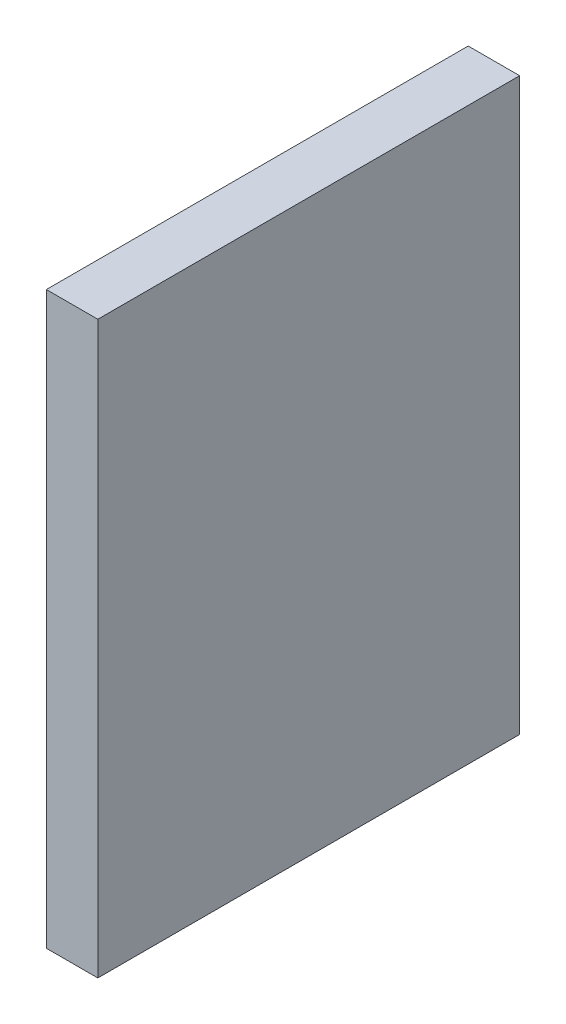
ISO-10303-21;
HEADER;
FILE_DESCRIPTION(('STEP AP214'),'2;1');
FILE_NAME('part.step','',(''),(''),'','','');
FILE_SCHEMA(('AUTOMOTIVE_DESIGN { 1 0 10303 214 1 1 1 1 }'));
ENDSEC;
DATA;
#1=APPLICATION_CONTEXT('core data for automotive mechanical design processes');
#2=APPLICATION_PROTOCOL_DEFINITION('international standard','automotive_design',2000,#1);
#3=PRODUCT_CONTEXT('',#1,'mechanical');
#4=PRODUCT('Part','Part','',(#3));
#5=PRODUCT_RELATED_PRODUCT_CATEGORY('part','',(#4));
#6=PRODUCT_DEFINITION_FORMATION('','',#4);
#7=PRODUCT_DEFINITION_CONTEXT('part definition',#1,'design');
#8=PRODUCT_DEFINITION('design','',#6,#7);
#9=PRODUCT_DEFINITION_SHAPE('','',#8);
#10=(LENGTH_UNIT() NAMED_UNIT(*) SI_UNIT(.MILLI.,.METRE.));
#11=(NAMED_UNIT(*) PLANE_ANGLE_UNIT() SI_UNIT($,.RADIAN.));
#12=(NAMED_UNIT(*) SI_UNIT($,.STERADIAN.) SOLID_ANGLE_UNIT());
#13=UNCERTAINTY_MEASURE_WITH_UNIT(LENGTH_MEASURE(1.E-05),#10,'distance_accuracy_value','');
#14=(GEOMETRIC_REPRESENTATION_CONTEXT(3) GLOBAL_UNCERTAINTY_ASSIGNED_CONTEXT((#13)) GLOBAL_UNIT_ASSIGNED_CONTEXT((#10,
#11,#12)) REPRESENTATION_CONTEXT('',''));
#15=CARTESIAN_POINT('',(0.,0.,0.));
#16=DIRECTION('',(0.,0.,1.));
#17=DIRECTION('',(1.,0.,0.));
#18=AXIS2_PLACEMENT_3D('',#15,#16,#17);
#19=CARTESIAN_POINT('',(3.,-21.4079773002372,25.6905155489982));
#20=DIRECTION('',(0.,1.,0.));
#21=DIRECTION('',(0.,0.,1.));
#22=AXIS2_PLACEMENT_3D('',#19,#20,#21);
#23=PLANE('',#22);
#24=DIRECTION('',(0.,0.,-1.));
#25=VECTOR('',#24,1.);
#26=CARTESIAN_POINT('',(0.,-21.4079773002372,25.6905155489982));
#27=LINE('',#26,#25);
#28=CARTESIAN_POINT('',(0.,-21.4079773002372,25.6905155489982));
#29=VERTEX_POINT('',#28);
#30=CARTESIAN_POINT('',(0.,-21.4079773002372,1.09051554899822));
#31=VERTEX_POINT('',#30);
#32=EDGE_CURVE('E96',#29,#31,#27,.T.);
#33=ORIENTED_EDGE('',*,*,#32,.T.);
#34=DIRECTION('',(-1.,0.,0.));
#35=VECTOR('',#34,1.);
#36=CARTESIAN_POINT('',(3.,-21.4079773002372,1.09051554899822));
#37=LINE('',#36,#35);
#38=CARTESIAN_POINT('',(3.,-21.4079773002372,1.09051554899822));
#39=VERTEX_POINT('',#38);
#40=EDGE_CURVE('E11',#39,#31,#37,.T.);
#41=ORIENTED_EDGE('',*,*,#40,.F.);
#42=DIRECTION('',(0.,0.,-1.));
#43=VECTOR('',#42,1.);
#44=CARTESIAN_POINT('',(3.,-21.4079773002372,25.6905155489982));
#45=LINE('',#44,#43);
#46=CARTESIAN_POINT('',(3.,-21.4079773002372,25.6905155489982));
#47=VERTEX_POINT('',#46);
#48=EDGE_CURVE('E84',#47,#39,#45,.T.);
#49=ORIENTED_EDGE('',*,*,#48,.F.);
#50=DIRECTION('',(-1.,0.,0.));
#51=VECTOR('',#50,1.);
#52=CARTESIAN_POINT('',(3.,-21.4079773002372,25.6905155489982));
#53=LINE('',#52,#51);
#54=EDGE_CURVE('E92',#47,#29,#53,.T.);
#55=ORIENTED_EDGE('',*,*,#54,.T.);
#56=EDGE_LOOP('',(#33,#41,#49,#55));
#57=FACE_BOUND('',#56,.T.);
#58=ADVANCED_FACE('F33',(#57),#23,.F.);
#59=CARTESIAN_POINT('',(3.,-21.4079773002372,1.09051554899822));
#60=DIRECTION('',(0.,0.,1.));
#61=DIRECTION('',(1.,0.,0.));
#62=AXIS2_PLACEMENT_3D('',#59,#60,#61);
#63=PLANE('',#62);
#64=DIRECTION('',(0.,1.,0.));
#65=VECTOR('',#64,1.);
#66=CARTESIAN_POINT('',(0.,-21.4079773002372,1.09051554899822));
#67=LINE('',#66,#65);
#68=CARTESIAN_POINT('',(0.,11.8622632455059,1.09051554899822));
#69=VERTEX_POINT('',#68);
#70=EDGE_CURVE('E88',#31,#69,#67,.T.);
#71=ORIENTED_EDGE('',*,*,#70,.T.);
#72=DIRECTION('',(-1.,0.,0.));
#73=VECTOR('',#72,1.);
#74=CARTESIAN_POINT('',(3.,11.8622632455059,1.09051554899822));
#75=LINE('',#74,#73);
#76=CARTESIAN_POINT('',(3.,11.8622632455059,1.09051554899822));
#77=VERTEX_POINT('',#76);
#78=EDGE_CURVE('E41',#77,#69,#75,.T.);
#79=ORIENTED_EDGE('',*,*,#78,.F.);
#80=DIRECTION('',(0.,1.,0.));
#81=VECTOR('',#80,1.);
#82=CARTESIAN_POINT('',(3.,-21.4079773002372,1.09051554899822));
#83=LINE('',#82,#81);
#84=EDGE_CURVE('E79',#39,#77,#83,.T.);
#85=ORIENTED_EDGE('',*,*,#84,.F.);
#86=ORIENTED_EDGE('',*,*,#40,.T.);
#87=EDGE_LOOP('',(#71,#79,#85,#86));
#88=FACE_BOUND('',#87,.T.);
#89=ADVANCED_FACE('F87',(#88),#63,.F.);
#90=CARTESIAN_POINT('',(3.,11.8622632455059,1.09051554899822));
#91=DIRECTION('',(0.,-1.,0.));
#92=DIRECTION('',(0.,0.,-1.));
#93=AXIS2_PLACEMENT_3D('',#90,#91,#92);
#94=PLANE('',#93);
#95=DIRECTION('',(0.,0.,1.));
#96=VECTOR('',#95,1.);
#97=CARTESIAN_POINT('',(0.,11.8622632455059,1.09051554899822));
#98=LINE('',#97,#96);
#99=CARTESIAN_POINT('',(0.,11.8622632455059,25.6905155489982));
#100=VERTEX_POINT('',#99);
#101=EDGE_CURVE('E66',#69,#100,#98,.T.);
#102=ORIENTED_EDGE('',*,*,#101,.T.);
#103=DIRECTION('',(-1.,0.,0.));
#104=VECTOR('',#103,1.);
#105=CARTESIAN_POINT('',(3.,11.8622632455059,25.6905155489982));
#106=LINE('',#105,#104);
#107=CARTESIAN_POINT('',(3.,11.8622632455059,25.6905155489982));
#108=VERTEX_POINT('',#107);
#109=EDGE_CURVE('E89',#108,#100,#106,.T.);
#110=ORIENTED_EDGE('',*,*,#109,.F.);
#111=DIRECTION('',(0.,0.,1.));
#112=VECTOR('',#111,1.);
#113=CARTESIAN_POINT('',(3.,11.8622632455059,1.09051554899822));
#114=LINE('',#113,#112);
#115=EDGE_CURVE('E82',#77,#108,#114,.T.);
#116=ORIENTED_EDGE('',*,*,#115,.F.);
#117=ORIENTED_EDGE('',*,*,#78,.T.);
#118=EDGE_LOOP('',(#102,#110,#116,#117));
#119=FACE_BOUND('',#118,.T.);
#120=ADVANCED_FACE('F90',(#119),#94,.F.);
#121=CARTESIAN_POINT('',(3.,11.8622632455059,25.6905155489982));
#122=DIRECTION('',(0.,0.,-1.));
#123=DIRECTION('',(-1.,0.,0.));
#124=AXIS2_PLACEMENT_3D('',#121,#122,#123);
#125=PLANE('',#124);
#126=DIRECTION('',(0.,-1.,0.));
#127=VECTOR('',#126,1.);
#128=CARTESIAN_POINT('',(0.,11.8622632455059,25.6905155489982));
#129=LINE('',#128,#127);
#130=EDGE_CURVE('E72',#100,#29,#129,.T.);
#131=ORIENTED_EDGE('',*,*,#130,.T.);
#132=ORIENTED_EDGE('',*,*,#54,.F.);
#133=DIRECTION('',(0.,-1.,0.));
#134=VECTOR('',#133,1.);
#135=CARTESIAN_POINT('',(3.,11.8622632455059,25.6905155489982));
#136=LINE('',#135,#134);
#137=EDGE_CURVE('E49',#108,#47,#136,.T.);
#138=ORIENTED_EDGE('',*,*,#137,.F.);
#139=ORIENTED_EDGE('',*,*,#109,.T.);
#140=EDGE_LOOP('',(#131,#132,#138,#139));
#141=FACE_BOUND('',#140,.T.);
#142=ADVANCED_FACE('F103',(#141),#125,.F.);
#143=CARTESIAN_POINT('',(3.,0.,0.));
#144=DIRECTION('',(1.,0.,0.));
#145=DIRECTION('',(0.,0.,-1.));
#146=AXIS2_PLACEMENT_3D('',#143,#144,#145);
#147=PLANE('',#146);
#148=ORIENTED_EDGE('',*,*,#48,.T.);
#149=ORIENTED_EDGE('',*,*,#84,.T.);
#150=ORIENTED_EDGE('',*,*,#115,.T.);
#151=ORIENTED_EDGE('',*,*,#137,.T.);
#152=EDGE_LOOP('',(#148,#149,#150,#151));
#153=FACE_BOUND('',#152,.T.);
#154=ADVANCED_FACE('F80',(#153),#147,.T.);
#155=CARTESIAN_POINT('',(0.,0.,0.));
#156=DIRECTION('',(1.,0.,0.));
#157=DIRECTION('',(0.,0.,-1.));
#158=AXIS2_PLACEMENT_3D('',#155,#156,#157);
#159=PLANE('',#158);
#160=ORIENTED_EDGE('',*,*,#32,.F.);
#161=ORIENTED_EDGE('',*,*,#130,.F.);
#162=ORIENTED_EDGE('',*,*,#101,.F.);
#163=ORIENTED_EDGE('',*,*,#70,.F.);
#164=EDGE_LOOP('',(#160,#161,#162,#163));
#165=FACE_BOUND('',#164,.T.);
#166=ADVANCED_FACE('F106',(#165),#159,.F.);
#167=CLOSED_SHELL('',(#58,#89,#120,#142,#154,#166));
#168=MANIFOLD_SOLID_BREP('B2',#167);
#169=ADVANCED_BREP_SHAPE_REPRESENTATION('',(#18,#168),#14);
#170=SHAPE_DEFINITION_REPRESENTATION(#9,#169);
ENDSEC;
END-ISO-10303-21;
